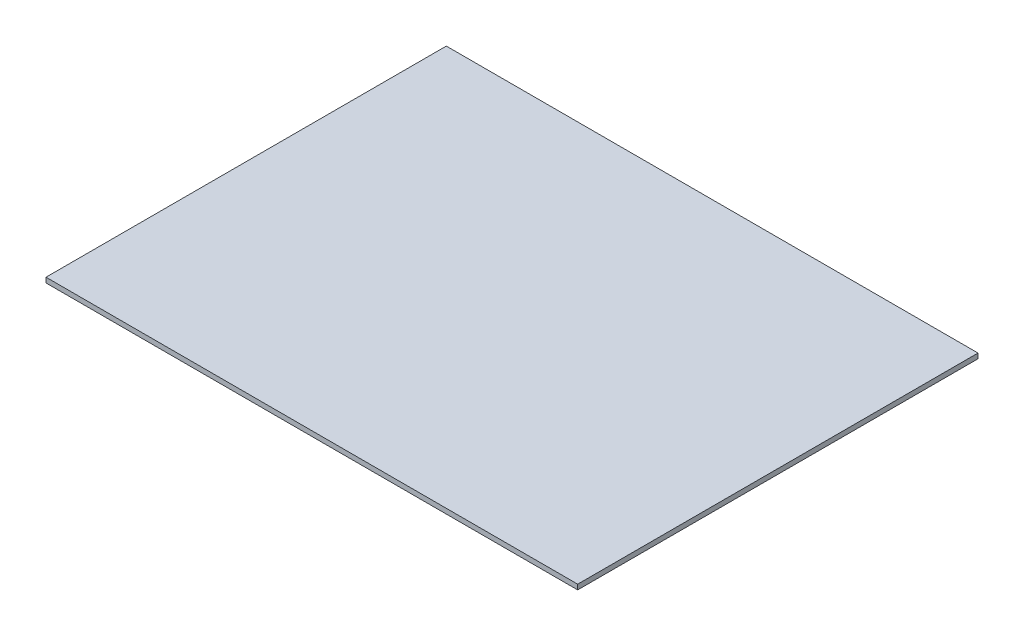
ISO-10303-21;
HEADER;
FILE_DESCRIPTION(('STEP AP214'),'2;1');
FILE_NAME('part.step','',(''),(''),'','','');
FILE_SCHEMA(('AUTOMOTIVE_DESIGN { 1 0 10303 214 1 1 1 1 }'));
ENDSEC;
DATA;
#1=APPLICATION_CONTEXT('core data for automotive mechanical design processes');
#2=APPLICATION_PROTOCOL_DEFINITION('international standard','automotive_design',2000,#1);
#3=PRODUCT_CONTEXT('',#1,'mechanical');
#4=PRODUCT('Part','Part','',(#3));
#5=PRODUCT_RELATED_PRODUCT_CATEGORY('part','',(#4));
#6=PRODUCT_DEFINITION_FORMATION('','',#4);
#7=PRODUCT_DEFINITION_CONTEXT('part definition',#1,'design');
#8=PRODUCT_DEFINITION('design','',#6,#7);
#9=PRODUCT_DEFINITION_SHAPE('','',#8);
#10=(LENGTH_UNIT() NAMED_UNIT(*) SI_UNIT(.MILLI.,.METRE.));
#11=(NAMED_UNIT(*) PLANE_ANGLE_UNIT() SI_UNIT($,.RADIAN.));
#12=(NAMED_UNIT(*) SI_UNIT($,.STERADIAN.) SOLID_ANGLE_UNIT());
#13=UNCERTAINTY_MEASURE_WITH_UNIT(LENGTH_MEASURE(1.E-05),#10,'distance_accuracy_value','');
#14=(GEOMETRIC_REPRESENTATION_CONTEXT(3) GLOBAL_UNCERTAINTY_ASSIGNED_CONTEXT((#13)) GLOBAL_UNIT_ASSIGNED_CONTEXT((#10,
#11,#12)) REPRESENTATION_CONTEXT('',''));
#15=CARTESIAN_POINT('',(0.,0.,0.));
#16=DIRECTION('',(0.,0.,1.));
#17=DIRECTION('',(1.,0.,0.));
#18=AXIS2_PLACEMENT_3D('',#15,#16,#17);
#19=CARTESIAN_POINT('',(212.5,4.,160.));
#20=DIRECTION('',(-1.,0.,0.));
#21=DIRECTION('',(0.,0.,1.));
#22=AXIS2_PLACEMENT_3D('',#19,#20,#21);
#23=PLANE('',#22);
#24=DIRECTION('',(0.,0.,-1.));
#25=VECTOR('',#24,1.);
#26=CARTESIAN_POINT('',(212.5,0.,160.));
#27=LINE('',#26,#25);
#28=CARTESIAN_POINT('',(212.5,0.,160.));
#29=VERTEX_POINT('',#28);
#30=CARTESIAN_POINT('',(212.5,0.,-160.));
#31=VERTEX_POINT('',#30);
#32=EDGE_CURVE('E97',#29,#31,#27,.T.);
#33=ORIENTED_EDGE('',*,*,#32,.T.);
#34=DIRECTION('',(0.,-1.,0.));
#35=VECTOR('',#34,1.);
#36=CARTESIAN_POINT('',(212.5,4.,-160.));
#37=LINE('',#36,#35);
#38=CARTESIAN_POINT('',(212.5,4.,-160.));
#39=VERTEX_POINT('',#38);
#40=EDGE_CURVE('E11',#39,#31,#37,.T.);
#41=ORIENTED_EDGE('',*,*,#40,.F.);
#42=DIRECTION('',(0.,0.,-1.));
#43=VECTOR('',#42,1.);
#44=CARTESIAN_POINT('',(212.5,4.,160.));
#45=LINE('',#44,#43);
#46=CARTESIAN_POINT('',(212.5,4.,160.));
#47=VERTEX_POINT('',#46);
#48=EDGE_CURVE('E85',#47,#39,#45,.T.);
#49=ORIENTED_EDGE('',*,*,#48,.F.);
#50=DIRECTION('',(0.,-1.,0.));
#51=VECTOR('',#50,1.);
#52=CARTESIAN_POINT('',(212.5,4.,160.));
#53=LINE('',#52,#51);
#54=EDGE_CURVE('E93',#47,#29,#53,.T.);
#55=ORIENTED_EDGE('',*,*,#54,.T.);
#56=EDGE_LOOP('',(#33,#41,#49,#55));
#57=FACE_BOUND('',#56,.T.);
#58=ADVANCED_FACE('F34',(#57),#23,.F.);
#59=CARTESIAN_POINT('',(-212.5,4.,-160.));
#60=DIRECTION('',(0.,0.,1.));
#61=DIRECTION('',(1.,0.,0.));
#62=AXIS2_PLACEMENT_3D('',#59,#60,#61);
#63=PLANE('',#62);
#64=DIRECTION('',(-1.,0.,0.));
#65=VECTOR('',#64,1.);
#66=CARTESIAN_POINT('',(-212.5,0.,-160.));
#67=LINE('',#66,#65);
#68=CARTESIAN_POINT('',(-212.5,0.,-160.));
#69=VERTEX_POINT('',#68);
#70=EDGE_CURVE('E89',#31,#69,#67,.T.);
#71=ORIENTED_EDGE('',*,*,#70,.T.);
#72=DIRECTION('',(0.,-1.,0.));
#73=VECTOR('',#72,1.);
#74=CARTESIAN_POINT('',(-212.5,4.,-160.));
#75=LINE('',#74,#73);
#76=CARTESIAN_POINT('',(-212.5,4.,-160.));
#77=VERTEX_POINT('',#76);
#78=EDGE_CURVE('E42',#77,#69,#75,.T.);
#79=ORIENTED_EDGE('',*,*,#78,.F.);
#80=DIRECTION('',(-1.,0.,0.));
#81=VECTOR('',#80,1.);
#82=CARTESIAN_POINT('',(-212.5,4.,-160.));
#83=LINE('',#82,#81);
#84=EDGE_CURVE('E80',#39,#77,#83,.T.);
#85=ORIENTED_EDGE('',*,*,#84,.F.);
#86=ORIENTED_EDGE('',*,*,#40,.T.);
#87=EDGE_LOOP('',(#71,#79,#85,#86));
#88=FACE_BOUND('',#87,.T.);
#89=ADVANCED_FACE('F88',(#88),#63,.F.);
#90=CARTESIAN_POINT('',(-212.5,4.,160.));
#91=DIRECTION('',(1.,0.,0.));
#92=DIRECTION('',(0.,0.,-1.));
#93=AXIS2_PLACEMENT_3D('',#90,#91,#92);
#94=PLANE('',#93);
#95=DIRECTION('',(0.,0.,1.));
#96=VECTOR('',#95,1.);
#97=CARTESIAN_POINT('',(-212.5,0.,160.));
#98=LINE('',#97,#96);
#99=CARTESIAN_POINT('',(-212.5,0.,160.));
#100=VERTEX_POINT('',#99);
#101=EDGE_CURVE('E67',#69,#100,#98,.T.);
#102=ORIENTED_EDGE('',*,*,#101,.T.);
#103=DIRECTION('',(0.,-1.,0.));
#104=VECTOR('',#103,1.);
#105=CARTESIAN_POINT('',(-212.5,4.,160.));
#106=LINE('',#105,#104);
#107=CARTESIAN_POINT('',(-212.5,4.,160.));
#108=VERTEX_POINT('',#107);
#109=EDGE_CURVE('E90',#108,#100,#106,.T.);
#110=ORIENTED_EDGE('',*,*,#109,.F.);
#111=DIRECTION('',(0.,0.,1.));
#112=VECTOR('',#111,1.);
#113=CARTESIAN_POINT('',(-212.5,4.,160.));
#114=LINE('',#113,#112);
#115=EDGE_CURVE('E83',#77,#108,#114,.T.);
#116=ORIENTED_EDGE('',*,*,#115,.F.);
#117=ORIENTED_EDGE('',*,*,#78,.T.);
#118=EDGE_LOOP('',(#102,#110,#116,#117));
#119=FACE_BOUND('',#118,.T.);
#120=ADVANCED_FACE('F91',(#119),#94,.F.);
#121=CARTESIAN_POINT('',(-212.5,4.,160.));
#122=DIRECTION('',(0.,0.,-1.));
#123=DIRECTION('',(-1.,0.,0.));
#124=AXIS2_PLACEMENT_3D('',#121,#122,#123);
#125=PLANE('',#124);
#126=DIRECTION('',(1.,0.,0.));
#127=VECTOR('',#126,1.);
#128=CARTESIAN_POINT('',(-212.5,0.,160.));
#129=LINE('',#128,#127);
#130=EDGE_CURVE('E73',#100,#29,#129,.T.);
#131=ORIENTED_EDGE('',*,*,#130,.T.);
#132=ORIENTED_EDGE('',*,*,#54,.F.);
#133=DIRECTION('',(1.,0.,0.));
#134=VECTOR('',#133,1.);
#135=CARTESIAN_POINT('',(-212.5,4.,160.));
#136=LINE('',#135,#134);
#137=EDGE_CURVE('E50',#108,#47,#136,.T.);
#138=ORIENTED_EDGE('',*,*,#137,.F.);
#139=ORIENTED_EDGE('',*,*,#109,.T.);
#140=EDGE_LOOP('',(#131,#132,#138,#139));
#141=FACE_BOUND('',#140,.T.);
#142=ADVANCED_FACE('F104',(#141),#125,.F.);
#143=CARTESIAN_POINT('',(0.,4.,0.));
#144=DIRECTION('',(0.,-1.,0.));
#145=DIRECTION('',(0.,0.,-1.));
#146=AXIS2_PLACEMENT_3D('',#143,#144,#145);
#147=PLANE('',#146);
#148=ORIENTED_EDGE('',*,*,#48,.T.);
#149=ORIENTED_EDGE('',*,*,#84,.T.);
#150=ORIENTED_EDGE('',*,*,#115,.T.);
#151=ORIENTED_EDGE('',*,*,#137,.T.);
#152=EDGE_LOOP('',(#148,#149,#150,#151));
#153=FACE_BOUND('',#152,.T.);
#154=ADVANCED_FACE('F81',(#153),#147,.F.);
#155=CARTESIAN_POINT('',(0.,0.,0.));
#156=DIRECTION('',(0.,-1.,0.));
#157=DIRECTION('',(0.,0.,-1.));
#158=AXIS2_PLACEMENT_3D('',#155,#156,#157);
#159=PLANE('',#158);
#160=ORIENTED_EDGE('',*,*,#32,.F.);
#161=ORIENTED_EDGE('',*,*,#130,.F.);
#162=ORIENTED_EDGE('',*,*,#101,.F.);
#163=ORIENTED_EDGE('',*,*,#70,.F.);
#164=EDGE_LOOP('',(#160,#161,#162,#163));
#165=FACE_BOUND('',#164,.T.);
#166=ADVANCED_FACE('F107',(#165),#159,.T.);
#167=CLOSED_SHELL('',(#58,#89,#120,#142,#154,#166));
#168=MANIFOLD_SOLID_BREP('B2',#167);
#169=ADVANCED_BREP_SHAPE_REPRESENTATION('',(#18,#168),#14);
#170=SHAPE_DEFINITION_REPRESENTATION(#9,#169);
ENDSEC;
END-ISO-10303-21;
